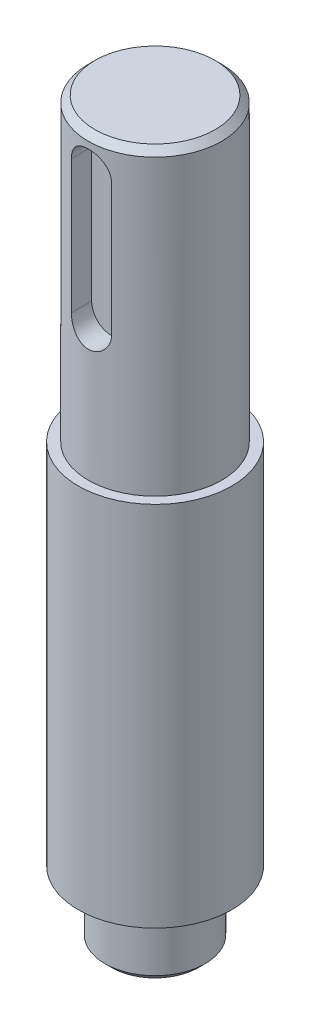
ISO-10303-21;
HEADER;
FILE_DESCRIPTION(('STEP AP214'),'2;1');
FILE_NAME('part.step','',(''),(''),'','','');
FILE_SCHEMA(('AUTOMOTIVE_DESIGN { 1 0 10303 214 1 1 1 1 }'));
ENDSEC;
DATA;
#1=APPLICATION_CONTEXT('core data for automotive mechanical design processes');
#2=APPLICATION_PROTOCOL_DEFINITION('international standard','automotive_design',2000,#1);
#3=PRODUCT_CONTEXT('',#1,'mechanical');
#4=PRODUCT('Part','Part','',(#3));
#5=PRODUCT_RELATED_PRODUCT_CATEGORY('part','',(#4));
#6=PRODUCT_DEFINITION_FORMATION('','',#4);
#7=PRODUCT_DEFINITION_CONTEXT('part definition',#1,'design');
#8=PRODUCT_DEFINITION('design','',#6,#7);
#9=PRODUCT_DEFINITION_SHAPE('','',#8);
#10=(LENGTH_UNIT() NAMED_UNIT(*) SI_UNIT(.MILLI.,.METRE.));
#11=(NAMED_UNIT(*) PLANE_ANGLE_UNIT() SI_UNIT($,.RADIAN.));
#12=(NAMED_UNIT(*) SI_UNIT($,.STERADIAN.) SOLID_ANGLE_UNIT());
#13=UNCERTAINTY_MEASURE_WITH_UNIT(LENGTH_MEASURE(1.E-05),#10,'distance_accuracy_value','');
#14=(GEOMETRIC_REPRESENTATION_CONTEXT(3) GLOBAL_UNCERTAINTY_ASSIGNED_CONTEXT((#13)) GLOBAL_UNIT_ASSIGNED_CONTEXT((#10,
#11,#12)) REPRESENTATION_CONTEXT('',''));
#15=CARTESIAN_POINT('',(0.,0.,0.));
#16=DIRECTION('',(0.,0.,1.));
#17=DIRECTION('',(1.,0.,0.));
#18=AXIS2_PLACEMENT_3D('',#15,#16,#17);
#19=CARTESIAN_POINT('',(0.,-110.,0.));
#20=DIRECTION('',(0.,-1.,0.));
#21=DIRECTION('',(0.,0.,-1.));
#22=AXIS2_PLACEMENT_3D('',#19,#20,#21);
#23=CYLINDRICAL_SURFACE('',#22,10.);
#24=CARTESIAN_POINT('',(0.,-45.,0.));
#25=DIRECTION('',(0.,-1.,0.));
#26=DIRECTION('',(0.,0.,-1.));
#27=AXIS2_PLACEMENT_3D('',#24,#25,#26);
#28=CIRCLE('',#27,10.);
#29=CARTESIAN_POINT('',(0.,-45.,-10.));
#30=VERTEX_POINT('',#29);
#31=EDGE_CURVE('E113',#30,#30,#28,.T.);
#32=ORIENTED_EDGE('',*,*,#31,.F.);
#33=EDGE_LOOP('',(#32));
#34=FACE_BOUND('',#33,.T.);
#35=CARTESIAN_POINT('',(0.,-1.00000000000001,0.));
#36=DIRECTION('',(0.,1.,0.));
#37=DIRECTION('',(0.,0.,1.));
#38=AXIS2_PLACEMENT_3D('',#35,#36,#37);
#39=CIRCLE('',#38,10.);
#40=CARTESIAN_POINT('',(0.,-1.00000000000001,10.));
#41=VERTEX_POINT('',#40);
#42=EDGE_CURVE('E116',#41,#41,#39,.F.);
#43=ORIENTED_EDGE('',*,*,#42,.T.);
#44=EDGE_LOOP('',(#43));
#45=FACE_BOUND('',#44,.T.);
#46=DIRECTION('',(0.,-1.,0.));
#47=VECTOR('',#46,1.);
#48=CARTESIAN_POINT('',(-2.99999999999999,-110.,9.53939201416946));
#49=LINE('',#48,#47);
#50=CARTESIAN_POINT('',(-3.,-25.,9.53939201416946));
#51=VERTEX_POINT('',#50);
#52=CARTESIAN_POINT('',(-3.,-5.,9.53939201416946));
#53=VERTEX_POINT('',#52);
#54=EDGE_CURVE('E133',#51,#53,#49,.F.);
#55=ORIENTED_EDGE('',*,*,#54,.T.);
#56=CARTESIAN_POINT('',(-3.,-5.,9.53939201416946));
#57=CARTESIAN_POINT('',(-3.00001027845728,-4.91766447917731,9.53938054248207));
#58=CARTESIAN_POINT('',(-2.99661062684472,-4.83533554493678,9.54045772064379));
#59=CARTESIAN_POINT('',(-2.98307142899347,-4.67130604723454,9.54470412105986));
#60=CARTESIAN_POINT('',(-2.97293339805418,-4.58960534667564,9.54787287296849));
#61=CARTESIAN_POINT('',(-2.94603140625045,-4.42761508432682,9.55620668351003));
#62=CARTESIAN_POINT('',(-2.92928426957737,-4.34732247595697,9.56136667250114));
#63=CARTESIAN_POINT('',(-2.88932853030394,-4.18852415586577,9.57351626651178));
#64=CARTESIAN_POINT('',(-2.8661197587264,-4.1100184909326,9.58050591937828));
#65=CARTESIAN_POINT('',(-2.78708584446024,-3.87805061200985,9.60391637654137));
#66=CARTESIAN_POINT('',(-2.72181852542972,-3.72793156116699,9.62279007830391));
#67=CARTESIAN_POINT('',(-2.56815043531275,-3.44077395602096,9.66493213967819));
#68=CARTESIAN_POINT('',(-2.4797388992416,-3.30374152923783,9.68820254290641));
#69=CARTESIAN_POINT('',(-2.27929879634442,-3.04227701205217,9.73733650515375));
#70=CARTESIAN_POINT('',(-2.16666914746584,-2.91831512593909,9.76325505469874));
#71=CARTESIAN_POINT('',(-1.92227736150433,-2.69072638516124,9.81429628475077));
#72=CARTESIAN_POINT('',(-1.79051199848164,-2.58710296613899,9.8394188301941));
#73=CARTESIAN_POINT('',(-1.50821997465697,-2.40107313490544,9.88666477976534));
#74=CARTESIAN_POINT('',(-1.35736167401016,-2.31914982021738,9.90871541546878));
#75=CARTESIAN_POINT('',(-1.04324233568303,-2.18202299599707,9.94668940088144));
#76=CARTESIAN_POINT('',(-0.879984508687984,-2.12681259663205,9.96261433032403));
#77=CARTESIAN_POINT('',(-0.550649404820601,-2.046240448209,9.98615279768398));
#78=CARTESIAN_POINT('',(-0.384786253016203,-2.02007029648238,9.99399098526792));
#79=CARTESIAN_POINT('',(-0.0508471415689276,-1.99576530485396,10.0012640407204));
#80=CARTESIAN_POINT('',(0.117228393125339,-1.99762515732182,10.0007004995012));
#81=CARTESIAN_POINT('',(0.445143199271825,-2.02878582069144,9.99139205125586));
#82=CARTESIAN_POINT('',(0.605074290763028,-2.05721069080812,9.98290831016512));
#83=CARTESIAN_POINT('',(0.917780104370314,-2.13926326962549,9.95903027401822));
#84=CARTESIAN_POINT('',(1.07055445110879,-2.19289229868268,9.94363561692558));
#85=CARTESIAN_POINT('',(1.36669563173912,-2.32442444352475,9.90730429851782));
#86=CARTESIAN_POINT('',(1.50993201207613,-2.4026032887761,9.88630511384915));
#87=CARTESIAN_POINT('',(1.781531059161,-2.58079718003441,9.84099249303647));
#88=CARTESIAN_POINT('',(1.9098903832325,-2.6808171189407,9.81667831471806));
#89=CARTESIAN_POINT('',(2.15330901082205,-2.90438397618464,9.7662334714278));
#90=CARTESIAN_POINT('',(2.26766702955975,-3.02868772752621,9.74006890899097));
#91=CARTESIAN_POINT('',(2.47413538985067,-3.29499484685111,9.68968430229327));
#92=CARTESIAN_POINT('',(2.5662392402618,-3.43700336072978,9.66546482675134));
#93=CARTESIAN_POINT('',(2.72632814481701,-3.73656185689986,9.62154457591303));
#94=CARTESIAN_POINT('',(2.79406012682263,-3.89425435918714,9.60189192491896));
#95=CARTESIAN_POINT('',(2.90171772009404,-4.21944900796315,9.56991327306403));
#96=CARTESIAN_POINT('',(2.94168586436072,-4.38693572142869,9.5575760695175));
#97=CARTESIAN_POINT('',(2.97802407180159,-4.6299897781404,9.54628064650012));
#98=CARTESIAN_POINT('',(2.98626405978017,-4.70378146835922,9.54370312550534));
#99=CARTESIAN_POINT('',(2.99724711229708,-4.85170295819904,9.54025857223565));
#100=CARTESIAN_POINT('',(2.99999825936538,-4.92583209932769,9.53938902493288));
#101=CARTESIAN_POINT('',(3.,-5.,9.53939201416946));
#102=B_SPLINE_CURVE_WITH_KNOTS('',3,(#56,#57,#58,#59,#60,#61,#62,#63,#64,#65,#66,#67,#68,#69,
#70,#71,#72,#73,#74,#75,#76,#77,#78,#79,#80,#81,#82,#83,#84,#85,#86,#87,#88,#89,#90,#91,#92,#93,
#94,#95,#96,#97,#98,#99,#100,#101),.UNSPECIFIED.,.F.,.F.,(4,2,2,2,2,2,2,2,2,2,2,2,2,2,2,2,2,2,2,
2,2,2,4),(0.,0.246918142439469,0.493780777706086,0.740019009623012,0.986263681482025,
1.47813347402025,1.97023245590779,2.47635119822766,2.98255536239033,3.4992281062007,
4.01576751791672,4.51753600864764,5.019209488041,5.50490358251092,5.99062312360831,
6.48200583350621,6.97349873739169,7.48389234847122,7.99443465298715,8.51013494368214,
9.02504345105574,9.24774267716777,9.47011372732391),.UNSPECIFIED.);
#103=CARTESIAN_POINT('',(3.,-5.,9.53939201416945));
#104=VERTEX_POINT('',#103);
#105=EDGE_CURVE('E58',#53,#104,#102,.T.);
#106=ORIENTED_EDGE('',*,*,#105,.T.);
#107=DIRECTION('',(0.,-1.,0.));
#108=VECTOR('',#107,1.);
#109=CARTESIAN_POINT('',(3.00000000000001,-110.,9.53939201416945));
#110=LINE('',#109,#108);
#111=CARTESIAN_POINT('',(3.00000000000001,-25.,9.53939201416945));
#112=VERTEX_POINT('',#111);
#113=EDGE_CURVE('E122',#104,#112,#110,.T.);
#114=ORIENTED_EDGE('',*,*,#113,.T.);
#115=CARTESIAN_POINT('',(3.,-25.,9.53939201416946));
#116=CARTESIAN_POINT('',(3.00001027845728,-25.0823355208227,9.53938054248207));
#117=CARTESIAN_POINT('',(2.99661062684473,-25.1646644550632,9.54045772064378));
#118=CARTESIAN_POINT('',(2.98307142899347,-25.3286939527655,9.54470412105986));
#119=CARTESIAN_POINT('',(2.97293339805419,-25.4103946533244,9.54787287296849));
#120=CARTESIAN_POINT('',(2.94603140625045,-25.5723849156732,9.55620668351003));
#121=CARTESIAN_POINT('',(2.92928426957737,-25.652677524043,9.56136667250114));
#122=CARTESIAN_POINT('',(2.88932853030395,-25.8114758441342,9.57351626651178));
#123=CARTESIAN_POINT('',(2.86611975872641,-25.8899815090674,9.58050591937828));
#124=CARTESIAN_POINT('',(2.78708584446025,-26.1219493879901,9.60391637654137));
#125=CARTESIAN_POINT('',(2.72181852542973,-26.272068438833,9.62279007830391));
#126=CARTESIAN_POINT('',(2.56815043531276,-26.559226043979,9.66493213967819));
#127=CARTESIAN_POINT('',(2.4797388992416,-26.6962584707622,9.68820254290641));
#128=CARTESIAN_POINT('',(2.27929879634443,-26.9577229879478,9.73733650515374));
#129=CARTESIAN_POINT('',(2.16666914746584,-27.0816848740609,9.76325505469874));
#130=CARTESIAN_POINT('',(1.92227736150433,-27.3092736148388,9.81429628475077));
#131=CARTESIAN_POINT('',(1.79051199848164,-27.412897033861,9.8394188301941));
#132=CARTESIAN_POINT('',(1.50821997465697,-27.5989268650946,9.88666477976534));
#133=CARTESIAN_POINT('',(1.35736167401016,-27.6808501797826,9.90871541546878));
#134=CARTESIAN_POINT('',(1.04324233568303,-27.8179770040029,9.94668940088144));
#135=CARTESIAN_POINT('',(0.879984508687988,-27.873187403368,9.96261433032403));
#136=CARTESIAN_POINT('',(0.550649404820605,-27.953759551791,9.98615279768398));
#137=CARTESIAN_POINT('',(0.384786253016207,-27.9799297035176,9.99399098526792));
#138=CARTESIAN_POINT('',(0.0508471415689323,-28.004234695146,10.0012640407204));
#139=CARTESIAN_POINT('',(-0.117228393125334,-28.0023748426782,10.0007004995012));
#140=CARTESIAN_POINT('',(-0.445143199271819,-27.9712141793086,9.99139205125586));
#141=CARTESIAN_POINT('',(-0.605074290763023,-27.9427893091919,9.98290831016512));
#142=CARTESIAN_POINT('',(-0.917780104370309,-27.8607367303745,9.95903027401822));
#143=CARTESIAN_POINT('',(-1.07055445110878,-27.8071077013173,9.94363561692558));
#144=CARTESIAN_POINT('',(-1.36669563173911,-27.6755755564753,9.90730429851782));
#145=CARTESIAN_POINT('',(-1.50993201207612,-27.5973967112239,9.88630511384915));
#146=CARTESIAN_POINT('',(-1.781531059161,-27.4192028199656,9.84099249303647));
#147=CARTESIAN_POINT('',(-1.9098903832325,-27.3191828810593,9.81667831471806));
#148=CARTESIAN_POINT('',(-2.15330901082205,-27.0956160238154,9.7662334714278));
#149=CARTESIAN_POINT('',(-2.26766702955975,-26.9713122724738,9.74006890899097));
#150=CARTESIAN_POINT('',(-2.47413538985066,-26.7050051531489,9.68968430229327));
#151=CARTESIAN_POINT('',(-2.5662392402618,-26.5629966392702,9.66546482675134));
#152=CARTESIAN_POINT('',(-2.72632814481701,-26.2634381431001,9.62154457591303));
#153=CARTESIAN_POINT('',(-2.79406012682262,-26.1057456408129,9.60189192491896));
#154=CARTESIAN_POINT('',(-2.90171772009404,-25.7805509920369,9.56991327306403));
#155=CARTESIAN_POINT('',(-2.94168586436072,-25.6130642785713,9.5575760695175));
#156=CARTESIAN_POINT('',(-2.97802407180158,-25.3700102218596,9.54628064650012));
#157=CARTESIAN_POINT('',(-2.98626405978017,-25.2962185316408,9.54370312550534));
#158=CARTESIAN_POINT('',(-2.99724711229708,-25.148297041801,9.54025857223565));
#159=CARTESIAN_POINT('',(-2.99999825936537,-25.0741679006723,9.53938902493288));
#160=CARTESIAN_POINT('',(-3.,-25.,9.53939201416946));
#161=B_SPLINE_CURVE_WITH_KNOTS('',3,(#115,#116,#117,#118,#119,#120,#121,#122,#123,#124,#125,
#126,#127,#128,#129,#130,#131,#132,#133,#134,#135,#136,#137,#138,#139,#140,#141,#142,#143,#144,
#145,#146,#147,#148,#149,#150,#151,#152,#153,#154,#155,#156,#157,#158,#159,#160),.UNSPECIFIED.,
.F.,.F.,(4,2,2,2,2,2,2,2,2,2,2,2,2,2,2,2,2,2,2,2,2,2,4),(0.,0.246918142439467,0.493780777706083,
0.740019009623012,0.986263681482023,1.47813347402025,1.97023245590779,2.47635119822766,
2.98255536239033,3.4992281062007,4.01576751791672,4.51753600864764,5.019209488041,
5.50490358251092,5.99062312360831,6.48200583350621,6.97349873739169,7.48389234847121,
7.99443465298715,8.51013494368214,9.02504345105573,9.24774267716777,9.47011372732391),.UNSPECIFIED.);
#162=EDGE_CURVE('E125',#112,#51,#161,.T.);
#163=ORIENTED_EDGE('',*,*,#162,.T.);
#164=EDGE_LOOP('',(#55,#106,#114,#163));
#165=FACE_BOUND('',#164,.T.);
#166=ADVANCED_FACE('F35',(#34,#45,#165),#23,.T.);
#167=CARTESIAN_POINT('',(0.,0.,0.));
#168=DIRECTION('',(0.,1.,0.));
#169=DIRECTION('',(0.,0.,1.));
#170=AXIS2_PLACEMENT_3D('',#167,#168,#169);
#171=PLANE('',#170);
#172=CARTESIAN_POINT('',(0.,0.,0.));
#173=DIRECTION('',(0.,1.,0.));
#174=DIRECTION('',(0.,0.,1.));
#175=AXIS2_PLACEMENT_3D('',#172,#173,#174);
#176=CIRCLE('',#175,8.99999999999998);
#177=CARTESIAN_POINT('',(0.,0.,8.99999999999998));
#178=VERTEX_POINT('',#177);
#179=EDGE_CURVE('E119',#178,#178,#176,.T.);
#180=ORIENTED_EDGE('',*,*,#179,.T.);
#181=EDGE_LOOP('',(#180));
#182=FACE_BOUND('',#181,.T.);
#183=ADVANCED_FACE('F168',(#182),#171,.T.);
#184=CARTESIAN_POINT('',(10.,-45.,0.));
#185=DIRECTION('',(0.,1.,0.));
#186=DIRECTION('',(0.,0.,1.));
#187=AXIS2_PLACEMENT_3D('',#184,#185,#186);
#188=PLANE('',#187);
#189=ORIENTED_EDGE('',*,*,#31,.T.);
#190=EDGE_LOOP('',(#189));
#191=FACE_BOUND('',#190,.T.);
#192=CARTESIAN_POINT('',(0.,-45.,0.));
#193=DIRECTION('',(0.,-1.,0.));
#194=DIRECTION('',(0.,0.,-1.));
#195=AXIS2_PLACEMENT_3D('',#192,#193,#194);
#196=CIRCLE('',#195,11.5);
#197=CARTESIAN_POINT('',(0.,-45.,-11.5));
#198=VERTEX_POINT('',#197);
#199=EDGE_CURVE('E110',#198,#198,#196,.T.);
#200=ORIENTED_EDGE('',*,*,#199,.F.);
#201=EDGE_LOOP('',(#200));
#202=FACE_BOUND('',#201,.T.);
#203=ADVANCED_FACE('F173',(#191,#202),#188,.T.);
#204=CARTESIAN_POINT('',(0.,-110.,0.));
#205=DIRECTION('',(0.,-1.,0.));
#206=DIRECTION('',(0.,0.,-1.));
#207=AXIS2_PLACEMENT_3D('',#204,#205,#206);
#208=CYLINDRICAL_SURFACE('',#207,11.5);
#209=ORIENTED_EDGE('',*,*,#199,.T.);
#210=EDGE_LOOP('',(#209));
#211=FACE_BOUND('',#210,.T.);
#212=CARTESIAN_POINT('',(0.,-100.,0.));
#213=DIRECTION('',(0.,-1.,0.));
#214=DIRECTION('',(0.,0.,-1.));
#215=AXIS2_PLACEMENT_3D('',#212,#213,#214);
#216=CIRCLE('',#215,11.5);
#217=CARTESIAN_POINT('',(0.,-100.,-11.5));
#218=VERTEX_POINT('',#217);
#219=EDGE_CURVE('E107',#218,#218,#216,.T.);
#220=ORIENTED_EDGE('',*,*,#219,.F.);
#221=EDGE_LOOP('',(#220));
#222=FACE_BOUND('',#221,.T.);
#223=ADVANCED_FACE('F256',(#211,#222),#208,.T.);
#224=CARTESIAN_POINT('',(11.5,-100.,0.));
#225=DIRECTION('',(0.,-1.,0.));
#226=DIRECTION('',(0.,0.,-1.));
#227=AXIS2_PLACEMENT_3D('',#224,#225,#226);
#228=PLANE('',#227);
#229=ORIENTED_EDGE('',*,*,#219,.T.);
#230=EDGE_LOOP('',(#229));
#231=FACE_BOUND('',#230,.T.);
#232=CARTESIAN_POINT('',(0.,-100.,0.));
#233=DIRECTION('',(0.,-1.,0.));
#234=DIRECTION('',(0.,0.,-1.));
#235=AXIS2_PLACEMENT_3D('',#232,#233,#234);
#236=CIRCLE('',#235,7.5);
#237=CARTESIAN_POINT('',(0.,-100.,-7.5));
#238=VERTEX_POINT('',#237);
#239=EDGE_CURVE('E82',#238,#238,#236,.T.);
#240=ORIENTED_EDGE('',*,*,#239,.F.);
#241=EDGE_LOOP('',(#240));
#242=FACE_BOUND('',#241,.T.);
#243=ADVANCED_FACE('F199',(#231,#242),#228,.T.);
#244=CARTESIAN_POINT('',(0.,-110.,0.));
#245=DIRECTION('',(0.,-1.,0.));
#246=DIRECTION('',(0.,0.,-1.));
#247=AXIS2_PLACEMENT_3D('',#244,#245,#246);
#248=CYLINDRICAL_SURFACE('',#247,7.5);
#249=CARTESIAN_POINT('',(0.,-109.,0.));
#250=DIRECTION('',(0.,-1.,0.));
#251=DIRECTION('',(0.,0.,-1.));
#252=AXIS2_PLACEMENT_3D('',#249,#250,#251);
#253=CIRCLE('',#252,7.5);
#254=CARTESIAN_POINT('',(0.,-109.,-7.5));
#255=VERTEX_POINT('',#254);
#256=EDGE_CURVE('E11',#255,#255,#253,.F.);
#257=ORIENTED_EDGE('',*,*,#256,.T.);
#258=EDGE_LOOP('',(#257));
#259=FACE_BOUND('',#258,.T.);
#260=ORIENTED_EDGE('',*,*,#239,.T.);
#261=EDGE_LOOP('',(#260));
#262=FACE_BOUND('',#261,.T.);
#263=ADVANCED_FACE('F194',(#259,#262),#248,.T.);
#264=CARTESIAN_POINT('',(7.5,-110.,0.));
#265=DIRECTION('',(0.,-1.,0.));
#266=DIRECTION('',(0.,0.,-1.));
#267=AXIS2_PLACEMENT_3D('',#264,#265,#266);
#268=PLANE('',#267);
#269=CARTESIAN_POINT('',(0.,-110.,0.));
#270=DIRECTION('',(0.,-1.,0.));
#271=DIRECTION('',(0.,0.,-1.));
#272=AXIS2_PLACEMENT_3D('',#269,#270,#271);
#273=CIRCLE('',#272,6.49999999999998);
#274=CARTESIAN_POINT('',(0.,-110.,-6.49999999999998));
#275=VERTEX_POINT('',#274);
#276=EDGE_CURVE('E43',#275,#275,#273,.T.);
#277=ORIENTED_EDGE('',*,*,#276,.T.);
#278=EDGE_LOOP('',(#277));
#279=FACE_BOUND('',#278,.T.);
#280=ADVANCED_FACE('F152',(#279),#268,.T.);
#281=CARTESIAN_POINT('',(0.,-1.00000000000001,0.));
#282=DIRECTION('',(0.,-1.,0.));
#283=DIRECTION('',(0.,0.,-1.));
#284=AXIS2_PLACEMENT_3D('',#281,#282,#283);
#285=CONICAL_SURFACE('',#284,10.,0.785398163397452);
#286=ORIENTED_EDGE('',*,*,#179,.F.);
#287=EDGE_LOOP('',(#286));
#288=FACE_BOUND('',#287,.T.);
#289=ORIENTED_EDGE('',*,*,#42,.F.);
#290=EDGE_LOOP('',(#289));
#291=FACE_BOUND('',#290,.T.);
#292=ADVANCED_FACE('F151',(#288,#291),#285,.T.);
#293=CARTESIAN_POINT('',(0.,-5.,11.5));
#294=DIRECTION('',(0.,0.,-1.));
#295=DIRECTION('',(-1.,0.,0.));
#296=AXIS2_PLACEMENT_3D('',#293,#294,#295);
#297=CYLINDRICAL_SURFACE('',#296,3.);
#298=DIRECTION('',(0.,0.,-1.));
#299=VECTOR('',#298,1.);
#300=CARTESIAN_POINT('',(-3.,-5.,11.5));
#301=LINE('',#300,#299);
#302=CARTESIAN_POINT('',(-3.,-5.,6.5));
#303=VERTEX_POINT('',#302);
#304=EDGE_CURVE('E75',#53,#303,#301,.T.);
#305=ORIENTED_EDGE('',*,*,#304,.T.);
#306=CARTESIAN_POINT('',(0.,-5.,6.5));
#307=DIRECTION('',(0.,0.,1.));
#308=DIRECTION('',(1.,0.,0.));
#309=AXIS2_PLACEMENT_3D('',#306,#307,#308);
#310=CIRCLE('',#309,3.);
#311=CARTESIAN_POINT('',(3.,-5.,6.5));
#312=VERTEX_POINT('',#311);
#313=EDGE_CURVE('E79',#312,#303,#310,.T.);
#314=ORIENTED_EDGE('',*,*,#313,.F.);
#315=DIRECTION('',(0.,0.,-1.));
#316=VECTOR('',#315,1.);
#317=CARTESIAN_POINT('',(3.,-5.,11.5));
#318=LINE('',#317,#316);
#319=EDGE_CURVE('E101',#104,#312,#318,.T.);
#320=ORIENTED_EDGE('',*,*,#319,.F.);
#321=ORIENTED_EDGE('',*,*,#105,.F.);
#322=EDGE_LOOP('',(#305,#314,#320,#321));
#323=FACE_BOUND('',#322,.T.);
#324=ADVANCED_FACE('F77',(#323),#297,.F.);
#325=CARTESIAN_POINT('',(-3.,-5.,11.5));
#326=DIRECTION('',(1.,0.,0.));
#327=DIRECTION('',(0.,1.,0.));
#328=AXIS2_PLACEMENT_3D('',#325,#326,#327);
#329=PLANE('',#328);
#330=DIRECTION('',(0.,0.,-1.));
#331=VECTOR('',#330,1.);
#332=CARTESIAN_POINT('',(-3.,-25.,11.5));
#333=LINE('',#332,#331);
#334=CARTESIAN_POINT('',(-3.,-25.,6.5));
#335=VERTEX_POINT('',#334);
#336=EDGE_CURVE('E83',#51,#335,#333,.T.);
#337=ORIENTED_EDGE('',*,*,#336,.T.);
#338=DIRECTION('',(0.,-1.,0.));
#339=VECTOR('',#338,1.);
#340=CARTESIAN_POINT('',(-3.,-5.,6.5));
#341=LINE('',#340,#339);
#342=EDGE_CURVE('E86',#303,#335,#341,.T.);
#343=ORIENTED_EDGE('',*,*,#342,.F.);
#344=ORIENTED_EDGE('',*,*,#304,.F.);
#345=ORIENTED_EDGE('',*,*,#54,.F.);
#346=EDGE_LOOP('',(#337,#343,#344,#345));
#347=FACE_BOUND('',#346,.T.);
#348=ADVANCED_FACE('F87',(#347),#329,.T.);
#349=CARTESIAN_POINT('',(0.,-25.,11.5));
#350=DIRECTION('',(0.,0.,-1.));
#351=DIRECTION('',(-1.,0.,0.));
#352=AXIS2_PLACEMENT_3D('',#349,#350,#351);
#353=CYLINDRICAL_SURFACE('',#352,3.);
#354=DIRECTION('',(0.,0.,-1.));
#355=VECTOR('',#354,1.);
#356=CARTESIAN_POINT('',(3.,-25.,11.5));
#357=LINE('',#356,#355);
#358=CARTESIAN_POINT('',(3.,-25.,6.5));
#359=VERTEX_POINT('',#358);
#360=EDGE_CURVE('E50',#112,#359,#357,.T.);
#361=ORIENTED_EDGE('',*,*,#360,.T.);
#362=CARTESIAN_POINT('',(0.,-25.,6.5));
#363=DIRECTION('',(0.,0.,1.));
#364=DIRECTION('',(1.,0.,0.));
#365=AXIS2_PLACEMENT_3D('',#362,#363,#364);
#366=CIRCLE('',#365,3.);
#367=EDGE_CURVE('E92',#335,#359,#366,.T.);
#368=ORIENTED_EDGE('',*,*,#367,.F.);
#369=ORIENTED_EDGE('',*,*,#336,.F.);
#370=ORIENTED_EDGE('',*,*,#162,.F.);
#371=EDGE_LOOP('',(#361,#368,#369,#370));
#372=FACE_BOUND('',#371,.T.);
#373=ADVANCED_FACE('F138',(#372),#353,.F.);
#374=CARTESIAN_POINT('',(3.,-5.,11.5));
#375=DIRECTION('',(-1.,0.,0.));
#376=DIRECTION('',(0.,-1.,0.));
#377=AXIS2_PLACEMENT_3D('',#374,#375,#376);
#378=PLANE('',#377);
#379=ORIENTED_EDGE('',*,*,#319,.T.);
#380=DIRECTION('',(0.,1.,0.));
#381=VECTOR('',#380,1.);
#382=CARTESIAN_POINT('',(3.,-5.,6.5));
#383=LINE('',#382,#381);
#384=EDGE_CURVE('E96',#359,#312,#383,.T.);
#385=ORIENTED_EDGE('',*,*,#384,.F.);
#386=ORIENTED_EDGE('',*,*,#360,.F.);
#387=ORIENTED_EDGE('',*,*,#113,.F.);
#388=EDGE_LOOP('',(#379,#385,#386,#387));
#389=FACE_BOUND('',#388,.T.);
#390=ADVANCED_FACE('F143',(#389),#378,.T.);
#391=CARTESIAN_POINT('',(0.,-5.,6.5));
#392=DIRECTION('',(0.,0.,1.));
#393=DIRECTION('',(1.,0.,0.));
#394=AXIS2_PLACEMENT_3D('',#391,#392,#393);
#395=PLANE('',#394);
#396=ORIENTED_EDGE('',*,*,#313,.T.);
#397=ORIENTED_EDGE('',*,*,#342,.T.);
#398=ORIENTED_EDGE('',*,*,#367,.T.);
#399=ORIENTED_EDGE('',*,*,#384,.T.);
#400=EDGE_LOOP('',(#396,#397,#398,#399));
#401=FACE_BOUND('',#400,.T.);
#402=ADVANCED_FACE('F95',(#401),#395,.T.);
#403=CARTESIAN_POINT('',(0.,-110.,0.));
#404=DIRECTION('',(0.,1.,0.));
#405=DIRECTION('',(0.,0.,1.));
#406=AXIS2_PLACEMENT_3D('',#403,#404,#405);
#407=CONICAL_SURFACE('',#406,6.49999999999998,0.785398163397452);
#408=ORIENTED_EDGE('',*,*,#256,.F.);
#409=EDGE_LOOP('',(#408));
#410=FACE_BOUND('',#409,.T.);
#411=ORIENTED_EDGE('',*,*,#276,.F.);
#412=EDGE_LOOP('',(#411));
#413=FACE_BOUND('',#412,.T.);
#414=ADVANCED_FACE('F37',(#410,#413),#407,.T.);
#415=CLOSED_SHELL('',(#166,#183,#203,#223,#243,#263,#280,#292,#324,#348,#373,#390,#402,#414));
#416=MANIFOLD_SOLID_BREP('B2',#415);
#417=ADVANCED_BREP_SHAPE_REPRESENTATION('',(#18,#416),#14);
#418=SHAPE_DEFINITION_REPRESENTATION(#9,#417);
ENDSEC;
END-ISO-10303-21;
